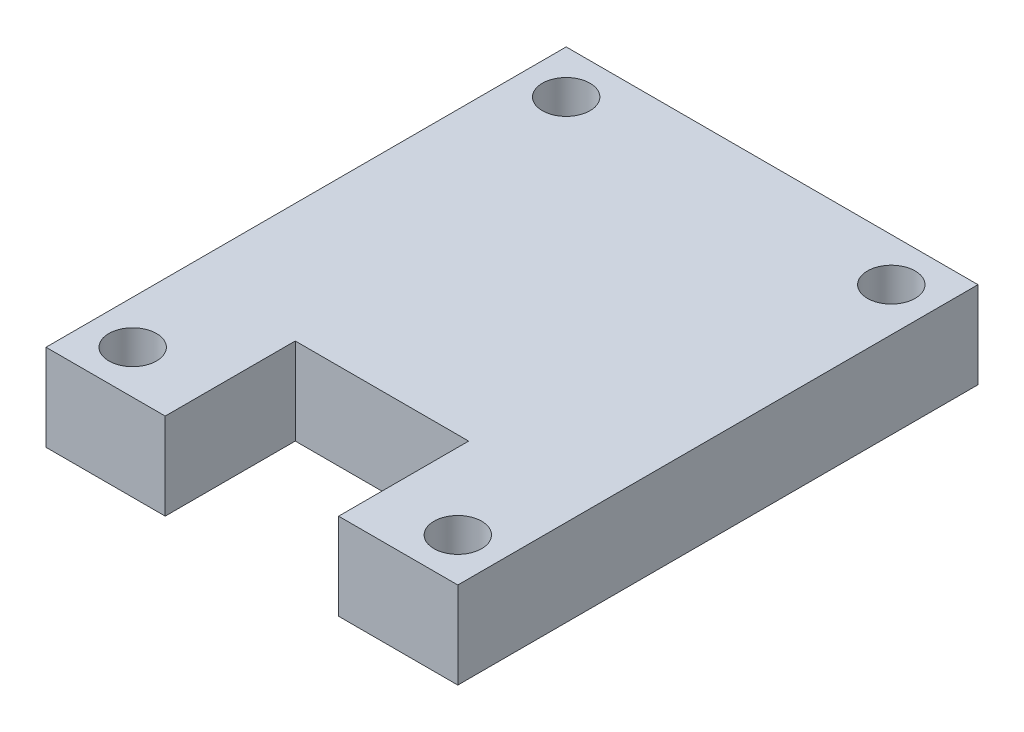
ISO-10303-21;
HEADER;
FILE_DESCRIPTION(('STEP AP214'),'2;1');
FILE_NAME('part.step','',(''),(''),'','','');
FILE_SCHEMA(('AUTOMOTIVE_DESIGN { 1 0 10303 214 1 1 1 1 }'));
ENDSEC;
DATA;
#1=APPLICATION_CONTEXT('core data for automotive mechanical design processes');
#2=APPLICATION_PROTOCOL_DEFINITION('international standard','automotive_design',2000,#1);
#3=PRODUCT_CONTEXT('',#1,'mechanical');
#4=PRODUCT('Part','Part','',(#3));
#5=PRODUCT_RELATED_PRODUCT_CATEGORY('part','',(#4));
#6=PRODUCT_DEFINITION_FORMATION('','',#4);
#7=PRODUCT_DEFINITION_CONTEXT('part definition',#1,'design');
#8=PRODUCT_DEFINITION('design','',#6,#7);
#9=PRODUCT_DEFINITION_SHAPE('','',#8);
#10=(LENGTH_UNIT() NAMED_UNIT(*) SI_UNIT(.MILLI.,.METRE.));
#11=(NAMED_UNIT(*) PLANE_ANGLE_UNIT() SI_UNIT($,.RADIAN.));
#12=(NAMED_UNIT(*) SI_UNIT($,.STERADIAN.) SOLID_ANGLE_UNIT());
#13=UNCERTAINTY_MEASURE_WITH_UNIT(LENGTH_MEASURE(1.E-05),#10,'distance_accuracy_value','');
#14=(GEOMETRIC_REPRESENTATION_CONTEXT(3) GLOBAL_UNCERTAINTY_ASSIGNED_CONTEXT((#13)) GLOBAL_UNIT_ASSIGNED_CONTEXT((#10,
#11,#12)) REPRESENTATION_CONTEXT('',''));
#15=CARTESIAN_POINT('',(0.,0.,0.));
#16=DIRECTION('',(0.,0.,1.));
#17=DIRECTION('',(1.,0.,0.));
#18=AXIS2_PLACEMENT_3D('',#15,#16,#17);
#19=CARTESIAN_POINT('',(0.,8.,0.));
#20=DIRECTION('',(0.,0.,-1.));
#21=DIRECTION('',(-1.,0.,0.));
#22=AXIS2_PLACEMENT_3D('',#19,#20,#21);
#23=PLANE('',#22);
#24=DIRECTION('',(1.,0.,0.));
#25=VECTOR('',#24,1.);
#26=CARTESIAN_POINT('',(0.,0.,0.));
#27=LINE('',#26,#25);
#28=CARTESIAN_POINT('',(0.,0.,0.));
#29=VERTEX_POINT('',#28);
#30=CARTESIAN_POINT('',(11.,0.,0.));
#31=VERTEX_POINT('',#30);
#32=EDGE_CURVE('E133',#29,#31,#27,.T.);
#33=ORIENTED_EDGE('',*,*,#32,.T.);
#34=DIRECTION('',(0.,1.,0.));
#35=VECTOR('',#34,1.);
#36=CARTESIAN_POINT('',(11.,0.,0.));
#37=LINE('',#36,#35);
#38=CARTESIAN_POINT('',(11.,8.,0.));
#39=VERTEX_POINT('',#38);
#40=EDGE_CURVE('E167',#31,#39,#37,.T.);
#41=ORIENTED_EDGE('',*,*,#40,.T.);
#42=DIRECTION('',(1.,0.,0.));
#43=VECTOR('',#42,1.);
#44=CARTESIAN_POINT('',(0.,8.,0.));
#45=LINE('',#44,#43);
#46=CARTESIAN_POINT('',(0.,8.,0.));
#47=VERTEX_POINT('',#46);
#48=EDGE_CURVE('E88',#47,#39,#45,.T.);
#49=ORIENTED_EDGE('',*,*,#48,.F.);
#50=DIRECTION('',(0.,-1.,0.));
#51=VECTOR('',#50,1.);
#52=CARTESIAN_POINT('',(0.,8.,0.));
#53=LINE('',#52,#51);
#54=EDGE_CURVE('E11',#47,#29,#53,.T.);
#55=ORIENTED_EDGE('',*,*,#54,.T.);
#56=EDGE_LOOP('',(#33,#41,#49,#55));
#57=FACE_BOUND('',#56,.T.);
#58=ADVANCED_FACE('F36',(#57),#23,.F.);
#59=CARTESIAN_POINT('',(0.,8.,-48.));
#60=DIRECTION('',(1.,0.,0.));
#61=DIRECTION('',(0.,0.,-1.));
#62=AXIS2_PLACEMENT_3D('',#59,#60,#61);
#63=PLANE('',#62);
#64=DIRECTION('',(0.,0.,1.));
#65=VECTOR('',#64,1.);
#66=CARTESIAN_POINT('',(0.,0.,-48.));
#67=LINE('',#66,#65);
#68=CARTESIAN_POINT('',(0.,0.,-48.));
#69=VERTEX_POINT('',#68);
#70=EDGE_CURVE('E134',#69,#29,#67,.T.);
#71=ORIENTED_EDGE('',*,*,#70,.T.);
#72=ORIENTED_EDGE('',*,*,#54,.F.);
#73=DIRECTION('',(0.,0.,1.));
#74=VECTOR('',#73,1.);
#75=CARTESIAN_POINT('',(0.,8.,-48.));
#76=LINE('',#75,#74);
#77=CARTESIAN_POINT('',(0.,8.,-48.));
#78=VERTEX_POINT('',#77);
#79=EDGE_CURVE('E144',#78,#47,#76,.T.);
#80=ORIENTED_EDGE('',*,*,#79,.F.);
#81=DIRECTION('',(0.,-1.,0.));
#82=VECTOR('',#81,1.);
#83=CARTESIAN_POINT('',(0.,8.,-48.));
#84=LINE('',#83,#82);
#85=EDGE_CURVE('E145',#78,#69,#84,.T.);
#86=ORIENTED_EDGE('',*,*,#85,.T.);
#87=EDGE_LOOP('',(#71,#72,#80,#86));
#88=FACE_BOUND('',#87,.T.);
#89=ADVANCED_FACE('F38',(#88),#63,.F.);
#90=CARTESIAN_POINT('',(27.,8.,0.));
#91=VERTEX_POINT('',#90);
#92=CARTESIAN_POINT('',(38.,8.,0.));
#93=VERTEX_POINT('',#92);
#94=EDGE_CURVE('E127',#91,#93,#45,.T.);
#95=ORIENTED_EDGE('',*,*,#94,.F.);
#96=DIRECTION('',(0.,1.,0.));
#97=VECTOR('',#96,1.);
#98=CARTESIAN_POINT('',(27.,0.,0.));
#99=LINE('',#98,#97);
#100=CARTESIAN_POINT('',(27.,0.,0.));
#101=VERTEX_POINT('',#100);
#102=EDGE_CURVE('E114',#101,#91,#99,.T.);
#103=ORIENTED_EDGE('',*,*,#102,.F.);
#104=CARTESIAN_POINT('',(38.,0.,0.));
#105=VERTEX_POINT('',#104);
#106=EDGE_CURVE('E125',#101,#105,#27,.T.);
#107=ORIENTED_EDGE('',*,*,#106,.T.);
#108=DIRECTION('',(0.,-1.,0.));
#109=VECTOR('',#108,1.);
#110=CARTESIAN_POINT('',(38.,8.,0.));
#111=LINE('',#110,#109);
#112=EDGE_CURVE('E44',#93,#105,#111,.T.);
#113=ORIENTED_EDGE('',*,*,#112,.F.);
#114=EDGE_LOOP('',(#95,#103,#107,#113));
#115=FACE_BOUND('',#114,.T.);
#116=ADVANCED_FACE('F123',(#115),#23,.F.);
#117=CARTESIAN_POINT('',(38.,8.,0.));
#118=DIRECTION('',(-1.,0.,0.));
#119=DIRECTION('',(0.,0.,1.));
#120=AXIS2_PLACEMENT_3D('',#117,#118,#119);
#121=PLANE('',#120);
#122=DIRECTION('',(0.,0.,-1.));
#123=VECTOR('',#122,1.);
#124=CARTESIAN_POINT('',(38.,0.,0.));
#125=LINE('',#124,#123);
#126=CARTESIAN_POINT('',(38.,0.,-48.));
#127=VERTEX_POINT('',#126);
#128=EDGE_CURVE('E132',#105,#127,#125,.T.);
#129=ORIENTED_EDGE('',*,*,#128,.T.);
#130=DIRECTION('',(0.,-1.,0.));
#131=VECTOR('',#130,1.);
#132=CARTESIAN_POINT('',(38.,8.,-48.));
#133=LINE('',#132,#131);
#134=CARTESIAN_POINT('',(38.,8.,-48.));
#135=VERTEX_POINT('',#134);
#136=EDGE_CURVE('E147',#135,#127,#133,.T.);
#137=ORIENTED_EDGE('',*,*,#136,.F.);
#138=DIRECTION('',(0.,0.,-1.));
#139=VECTOR('',#138,1.);
#140=CARTESIAN_POINT('',(38.,8.,0.));
#141=LINE('',#140,#139);
#142=EDGE_CURVE('E152',#93,#135,#141,.T.);
#143=ORIENTED_EDGE('',*,*,#142,.F.);
#144=ORIENTED_EDGE('',*,*,#112,.T.);
#145=EDGE_LOOP('',(#129,#137,#143,#144));
#146=FACE_BOUND('',#145,.T.);
#147=ADVANCED_FACE('F150',(#146),#121,.F.);
#148=CARTESIAN_POINT('',(38.,8.,-48.));
#149=DIRECTION('',(0.,0.,1.));
#150=DIRECTION('',(1.,0.,0.));
#151=AXIS2_PLACEMENT_3D('',#148,#149,#150);
#152=PLANE('',#151);
#153=DIRECTION('',(-1.,0.,0.));
#154=VECTOR('',#153,1.);
#155=CARTESIAN_POINT('',(38.,0.,-48.));
#156=LINE('',#155,#154);
#157=EDGE_CURVE('E81',#127,#69,#156,.T.);
#158=ORIENTED_EDGE('',*,*,#157,.T.);
#159=ORIENTED_EDGE('',*,*,#85,.F.);
#160=DIRECTION('',(-1.,0.,0.));
#161=VECTOR('',#160,1.);
#162=CARTESIAN_POINT('',(38.,8.,-48.));
#163=LINE('',#162,#161);
#164=EDGE_CURVE('E60',#135,#78,#163,.T.);
#165=ORIENTED_EDGE('',*,*,#164,.F.);
#166=ORIENTED_EDGE('',*,*,#136,.T.);
#167=EDGE_LOOP('',(#158,#159,#165,#166));
#168=FACE_BOUND('',#167,.T.);
#169=ADVANCED_FACE('F199',(#168),#152,.F.);
#170=CARTESIAN_POINT('',(0.,8.,0.));
#171=DIRECTION('',(0.,1.,0.));
#172=DIRECTION('',(0.,0.,1.));
#173=AXIS2_PLACEMENT_3D('',#170,#171,#172);
#174=PLANE('',#173);
#175=DIRECTION('',(0.,0.,1.));
#176=VECTOR('',#175,1.);
#177=CARTESIAN_POINT('',(11.,8.,0.));
#178=LINE('',#177,#176);
#179=CARTESIAN_POINT('',(11.,8.,-12.));
#180=VERTEX_POINT('',#179);
#181=EDGE_CURVE('E119',#180,#39,#178,.T.);
#182=ORIENTED_EDGE('',*,*,#181,.F.);
#183=DIRECTION('',(-1.,0.,0.));
#184=VECTOR('',#183,1.);
#185=CARTESIAN_POINT('',(11.,8.,-12.));
#186=LINE('',#185,#184);
#187=CARTESIAN_POINT('',(27.,8.,-12.));
#188=VERTEX_POINT('',#187);
#189=EDGE_CURVE('E186',#188,#180,#186,.T.);
#190=ORIENTED_EDGE('',*,*,#189,.F.);
#191=DIRECTION('',(0.,0.,-1.));
#192=VECTOR('',#191,1.);
#193=CARTESIAN_POINT('',(27.,8.,-12.));
#194=LINE('',#193,#192);
#195=EDGE_CURVE('E189',#91,#188,#194,.T.);
#196=ORIENTED_EDGE('',*,*,#195,.F.);
#197=ORIENTED_EDGE('',*,*,#94,.T.);
#198=ORIENTED_EDGE('',*,*,#142,.T.);
#199=ORIENTED_EDGE('',*,*,#164,.T.);
#200=ORIENTED_EDGE('',*,*,#79,.T.);
#201=ORIENTED_EDGE('',*,*,#48,.T.);
#202=EDGE_LOOP('',(#182,#190,#196,#197,#198,#199,#200,#201));
#203=FACE_BOUND('',#202,.T.);
#204=CARTESIAN_POINT('',(4.,8.,-44.));
#205=DIRECTION('',(0.,-1.,0.));
#206=DIRECTION('',(0.,0.,-1.));
#207=AXIS2_PLACEMENT_3D('',#204,#205,#206);
#208=CIRCLE('',#207,2.2);
#209=CARTESIAN_POINT('',(4.,8.,-46.2));
#210=VERTEX_POINT('',#209);
#211=EDGE_CURVE('E166',#210,#210,#208,.T.);
#212=ORIENTED_EDGE('',*,*,#211,.T.);
#213=EDGE_LOOP('',(#212));
#214=FACE_BOUND('',#213,.T.);
#215=CARTESIAN_POINT('',(34.,8.,-44.));
#216=DIRECTION('',(0.,-1.,0.));
#217=DIRECTION('',(0.,0.,-1.));
#218=AXIS2_PLACEMENT_3D('',#215,#216,#217);
#219=CIRCLE('',#218,2.2);
#220=CARTESIAN_POINT('',(34.,8.,-46.2));
#221=VERTEX_POINT('',#220);
#222=EDGE_CURVE('E173',#221,#221,#219,.T.);
#223=ORIENTED_EDGE('',*,*,#222,.T.);
#224=EDGE_LOOP('',(#223));
#225=FACE_BOUND('',#224,.T.);
#226=CARTESIAN_POINT('',(34.,8.,-4.));
#227=DIRECTION('',(0.,-1.,0.));
#228=DIRECTION('',(0.,0.,-1.));
#229=AXIS2_PLACEMENT_3D('',#226,#227,#228);
#230=CIRCLE('',#229,2.2);
#231=CARTESIAN_POINT('',(34.,8.,-6.2));
#232=VERTEX_POINT('',#231);
#233=EDGE_CURVE('E160',#232,#232,#230,.T.);
#234=ORIENTED_EDGE('',*,*,#233,.T.);
#235=EDGE_LOOP('',(#234));
#236=FACE_BOUND('',#235,.T.);
#237=CARTESIAN_POINT('',(4.,8.,-4.));
#238=DIRECTION('',(0.,-1.,0.));
#239=DIRECTION('',(0.,0.,-1.));
#240=AXIS2_PLACEMENT_3D('',#237,#238,#239);
#241=CIRCLE('',#240,2.2);
#242=CARTESIAN_POINT('',(4.,8.,-6.2));
#243=VERTEX_POINT('',#242);
#244=EDGE_CURVE('E138',#243,#243,#241,.T.);
#245=ORIENTED_EDGE('',*,*,#244,.T.);
#246=EDGE_LOOP('',(#245));
#247=FACE_BOUND('',#246,.T.);
#248=ADVANCED_FACE('F201',(#203,#214,#225,#236,#247),#174,.T.);
#249=CARTESIAN_POINT('',(0.,0.,0.));
#250=DIRECTION('',(0.,1.,0.));
#251=DIRECTION('',(0.,0.,1.));
#252=AXIS2_PLACEMENT_3D('',#249,#250,#251);
#253=PLANE('',#252);
#254=CARTESIAN_POINT('',(4.,0.,-44.));
#255=DIRECTION('',(0.,-1.,0.));
#256=DIRECTION('',(0.,0.,-1.));
#257=AXIS2_PLACEMENT_3D('',#254,#255,#256);
#258=CIRCLE('',#257,2.2);
#259=CARTESIAN_POINT('',(4.,0.,-46.2));
#260=VERTEX_POINT('',#259);
#261=EDGE_CURVE('E163',#260,#260,#258,.T.);
#262=ORIENTED_EDGE('',*,*,#261,.F.);
#263=EDGE_LOOP('',(#262));
#264=FACE_BOUND('',#263,.T.);
#265=CARTESIAN_POINT('',(34.,0.,-44.));
#266=DIRECTION('',(0.,-1.,0.));
#267=DIRECTION('',(0.,0.,-1.));
#268=AXIS2_PLACEMENT_3D('',#265,#266,#267);
#269=CIRCLE('',#268,2.2);
#270=CARTESIAN_POINT('',(34.,0.,-46.2));
#271=VERTEX_POINT('',#270);
#272=EDGE_CURVE('E170',#271,#271,#269,.T.);
#273=ORIENTED_EDGE('',*,*,#272,.F.);
#274=EDGE_LOOP('',(#273));
#275=FACE_BOUND('',#274,.T.);
#276=CARTESIAN_POINT('',(34.,0.,-4.));
#277=DIRECTION('',(0.,-1.,0.));
#278=DIRECTION('',(0.,0.,-1.));
#279=AXIS2_PLACEMENT_3D('',#276,#277,#278);
#280=CIRCLE('',#279,2.2);
#281=CARTESIAN_POINT('',(34.,0.,-6.2));
#282=VERTEX_POINT('',#281);
#283=EDGE_CURVE('E176',#282,#282,#280,.T.);
#284=ORIENTED_EDGE('',*,*,#283,.F.);
#285=EDGE_LOOP('',(#284));
#286=FACE_BOUND('',#285,.T.);
#287=CARTESIAN_POINT('',(4.,0.,-4.));
#288=DIRECTION('',(0.,-1.,0.));
#289=DIRECTION('',(0.,0.,-1.));
#290=AXIS2_PLACEMENT_3D('',#287,#288,#289);
#291=CIRCLE('',#290,2.2);
#292=CARTESIAN_POINT('',(4.,0.,-6.2));
#293=VERTEX_POINT('',#292);
#294=EDGE_CURVE('E157',#293,#293,#291,.T.);
#295=ORIENTED_EDGE('',*,*,#294,.F.);
#296=EDGE_LOOP('',(#295));
#297=FACE_BOUND('',#296,.T.);
#298=DIRECTION('',(-1.,0.,0.));
#299=VECTOR('',#298,1.);
#300=CARTESIAN_POINT('',(19.,0.,-12.));
#301=LINE('',#300,#299);
#302=CARTESIAN_POINT('',(27.,0.,-12.));
#303=VERTEX_POINT('',#302);
#304=CARTESIAN_POINT('',(11.,0.,-12.));
#305=VERTEX_POINT('',#304);
#306=EDGE_CURVE('E51',#303,#305,#301,.T.);
#307=ORIENTED_EDGE('',*,*,#306,.T.);
#308=DIRECTION('',(0.,0.,1.));
#309=VECTOR('',#308,1.);
#310=CARTESIAN_POINT('',(11.,0.,0.));
#311=LINE('',#310,#309);
#312=EDGE_CURVE('E128',#305,#31,#311,.T.);
#313=ORIENTED_EDGE('',*,*,#312,.T.);
#314=ORIENTED_EDGE('',*,*,#32,.F.);
#315=ORIENTED_EDGE('',*,*,#70,.F.);
#316=ORIENTED_EDGE('',*,*,#157,.F.);
#317=ORIENTED_EDGE('',*,*,#128,.F.);
#318=ORIENTED_EDGE('',*,*,#106,.F.);
#319=DIRECTION('',(0.,0.,-1.));
#320=VECTOR('',#319,1.);
#321=CARTESIAN_POINT('',(27.,0.,-12.));
#322=LINE('',#321,#320);
#323=EDGE_CURVE('E110',#101,#303,#322,.T.);
#324=ORIENTED_EDGE('',*,*,#323,.T.);
#325=EDGE_LOOP('',(#307,#313,#314,#315,#316,#317,#318,#324));
#326=FACE_BOUND('',#325,.T.);
#327=ADVANCED_FACE('F131',(#264,#275,#286,#297,#326),#253,.F.);
#328=CARTESIAN_POINT('',(4.,8.,-4.));
#329=DIRECTION('',(0.,-1.,0.));
#330=DIRECTION('',(0.,0.,-1.));
#331=AXIS2_PLACEMENT_3D('',#328,#329,#330);
#332=CYLINDRICAL_SURFACE('',#331,2.2);
#333=ORIENTED_EDGE('',*,*,#244,.F.);
#334=EDGE_LOOP('',(#333));
#335=FACE_BOUND('',#334,.T.);
#336=ORIENTED_EDGE('',*,*,#294,.T.);
#337=EDGE_LOOP('',(#336));
#338=FACE_BOUND('',#337,.T.);
#339=ADVANCED_FACE('F236',(#335,#338),#332,.F.);
#340=CARTESIAN_POINT('',(34.,8.,-4.));
#341=DIRECTION('',(0.,-1.,0.));
#342=DIRECTION('',(0.,0.,-1.));
#343=AXIS2_PLACEMENT_3D('',#340,#341,#342);
#344=CYLINDRICAL_SURFACE('',#343,2.2);
#345=ORIENTED_EDGE('',*,*,#233,.F.);
#346=EDGE_LOOP('',(#345));
#347=FACE_BOUND('',#346,.T.);
#348=ORIENTED_EDGE('',*,*,#283,.T.);
#349=EDGE_LOOP('',(#348));
#350=FACE_BOUND('',#349,.T.);
#351=ADVANCED_FACE('F241',(#347,#350),#344,.F.);
#352=CARTESIAN_POINT('',(34.,8.,-44.));
#353=DIRECTION('',(0.,-1.,0.));
#354=DIRECTION('',(0.,0.,-1.));
#355=AXIS2_PLACEMENT_3D('',#352,#353,#354);
#356=CYLINDRICAL_SURFACE('',#355,2.2);
#357=ORIENTED_EDGE('',*,*,#222,.F.);
#358=EDGE_LOOP('',(#357));
#359=FACE_BOUND('',#358,.T.);
#360=ORIENTED_EDGE('',*,*,#272,.T.);
#361=EDGE_LOOP('',(#360));
#362=FACE_BOUND('',#361,.T.);
#363=ADVANCED_FACE('F253',(#359,#362),#356,.F.);
#364=CARTESIAN_POINT('',(4.,8.,-44.));
#365=DIRECTION('',(0.,-1.,0.));
#366=DIRECTION('',(0.,0.,-1.));
#367=AXIS2_PLACEMENT_3D('',#364,#365,#366);
#368=CYLINDRICAL_SURFACE('',#367,2.2);
#369=ORIENTED_EDGE('',*,*,#211,.F.);
#370=EDGE_LOOP('',(#369));
#371=FACE_BOUND('',#370,.T.);
#372=ORIENTED_EDGE('',*,*,#261,.T.);
#373=EDGE_LOOP('',(#372));
#374=FACE_BOUND('',#373,.T.);
#375=ADVANCED_FACE('F263',(#371,#374),#368,.F.);
#376=CARTESIAN_POINT('',(11.,0.,0.));
#377=DIRECTION('',(-1.,0.,0.));
#378=DIRECTION('',(0.,0.,1.));
#379=AXIS2_PLACEMENT_3D('',#376,#377,#378);
#380=PLANE('',#379);
#381=ORIENTED_EDGE('',*,*,#181,.T.);
#382=ORIENTED_EDGE('',*,*,#40,.F.);
#383=ORIENTED_EDGE('',*,*,#312,.F.);
#384=DIRECTION('',(0.,1.,0.));
#385=VECTOR('',#384,1.);
#386=CARTESIAN_POINT('',(11.,0.,-12.));
#387=LINE('',#386,#385);
#388=EDGE_CURVE('E182',#305,#180,#387,.T.);
#389=ORIENTED_EDGE('',*,*,#388,.T.);
#390=EDGE_LOOP('',(#381,#382,#383,#389));
#391=FACE_BOUND('',#390,.T.);
#392=ADVANCED_FACE('F272',(#391),#380,.F.);
#393=CARTESIAN_POINT('',(11.,0.,-12.));
#394=DIRECTION('',(0.,0.,-1.));
#395=DIRECTION('',(-1.,0.,0.));
#396=AXIS2_PLACEMENT_3D('',#393,#394,#395);
#397=PLANE('',#396);
#398=ORIENTED_EDGE('',*,*,#189,.T.);
#399=ORIENTED_EDGE('',*,*,#388,.F.);
#400=ORIENTED_EDGE('',*,*,#306,.F.);
#401=DIRECTION('',(0.,1.,0.));
#402=VECTOR('',#401,1.);
#403=CARTESIAN_POINT('',(27.,0.,-12.));
#404=LINE('',#403,#402);
#405=EDGE_CURVE('E116',#303,#188,#404,.T.);
#406=ORIENTED_EDGE('',*,*,#405,.T.);
#407=EDGE_LOOP('',(#398,#399,#400,#406));
#408=FACE_BOUND('',#407,.T.);
#409=ADVANCED_FACE('F288',(#408),#397,.F.);
#410=CARTESIAN_POINT('',(27.,0.,-12.));
#411=DIRECTION('',(1.,0.,0.));
#412=DIRECTION('',(0.,0.,-1.));
#413=AXIS2_PLACEMENT_3D('',#410,#411,#412);
#414=PLANE('',#413);
#415=ORIENTED_EDGE('',*,*,#195,.T.);
#416=ORIENTED_EDGE('',*,*,#405,.F.);
#417=ORIENTED_EDGE('',*,*,#323,.F.);
#418=ORIENTED_EDGE('',*,*,#102,.T.);
#419=EDGE_LOOP('',(#415,#416,#417,#418));
#420=FACE_BOUND('',#419,.T.);
#421=ADVANCED_FACE('F113',(#420),#414,.F.);
#422=CLOSED_SHELL('',(#58,#89,#116,#147,#169,#248,#327,#339,#351,#363,#375,#392,#409,#421));
#423=MANIFOLD_SOLID_BREP('B2',#422);
#424=ADVANCED_BREP_SHAPE_REPRESENTATION('',(#18,#423),#14);
#425=SHAPE_DEFINITION_REPRESENTATION(#9,#424);
ENDSEC;
END-ISO-10303-21;
